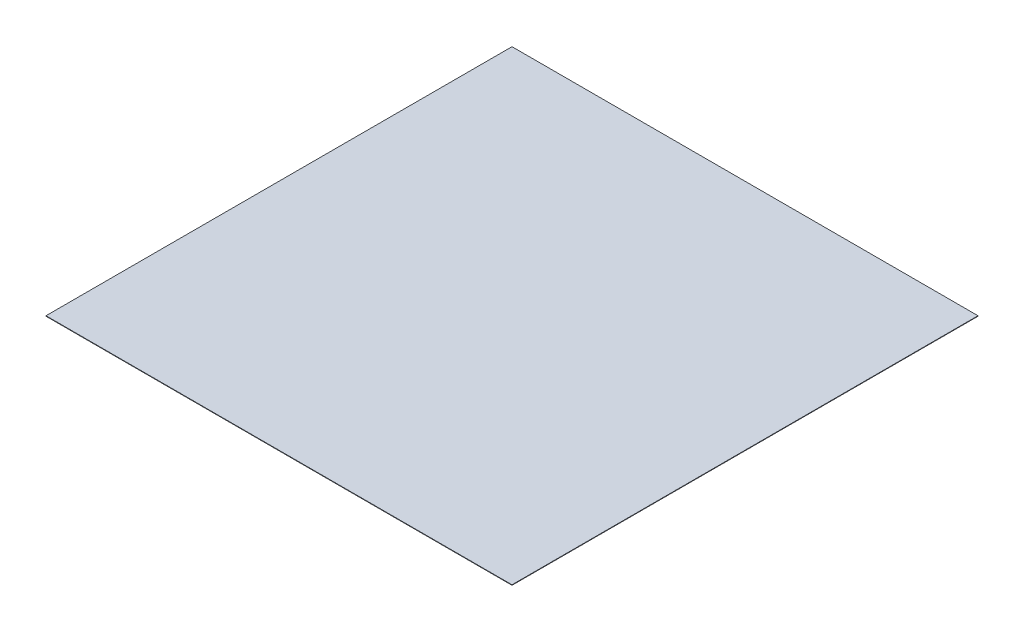
ISO-10303-21;
HEADER;
FILE_DESCRIPTION(('STEP AP214'),'2;1');
FILE_NAME('part.step','',(''),(''),'','','');
FILE_SCHEMA(('AUTOMOTIVE_DESIGN { 1 0 10303 214 1 1 1 1 }'));
ENDSEC;
DATA;
#1=APPLICATION_CONTEXT('core data for automotive mechanical design processes');
#2=APPLICATION_PROTOCOL_DEFINITION('international standard','automotive_design',2000,#1);
#3=PRODUCT_CONTEXT('',#1,'mechanical');
#4=PRODUCT('Part','Part','',(#3));
#5=PRODUCT_RELATED_PRODUCT_CATEGORY('part','',(#4));
#6=PRODUCT_DEFINITION_FORMATION('','',#4);
#7=PRODUCT_DEFINITION_CONTEXT('part definition',#1,'design');
#8=PRODUCT_DEFINITION('design','',#6,#7);
#9=PRODUCT_DEFINITION_SHAPE('','',#8);
#10=(LENGTH_UNIT() NAMED_UNIT(*) SI_UNIT(.MILLI.,.METRE.));
#11=(NAMED_UNIT(*) PLANE_ANGLE_UNIT() SI_UNIT($,.RADIAN.));
#12=(NAMED_UNIT(*) SI_UNIT($,.STERADIAN.) SOLID_ANGLE_UNIT());
#13=UNCERTAINTY_MEASURE_WITH_UNIT(LENGTH_MEASURE(1.E-05),#10,'distance_accuracy_value','');
#14=(GEOMETRIC_REPRESENTATION_CONTEXT(3) GLOBAL_UNCERTAINTY_ASSIGNED_CONTEXT((#13)) GLOBAL_UNIT_ASSIGNED_CONTEXT((#10,
#11,#12)) REPRESENTATION_CONTEXT('',''));
#15=CARTESIAN_POINT('',(0.,0.,0.));
#16=DIRECTION('',(0.,0.,1.));
#17=DIRECTION('',(1.,0.,0.));
#18=AXIS2_PLACEMENT_3D('',#15,#16,#17);
#19=CARTESIAN_POINT('',(0.,1.,1000.));
#20=DIRECTION('',(1.,0.,0.));
#21=DIRECTION('',(0.,0.,-1.));
#22=AXIS2_PLACEMENT_3D('',#19,#20,#21);
#23=PLANE('',#22);
#24=DIRECTION('',(0.,-1.,0.));
#25=VECTOR('',#24,1.);
#26=CARTESIAN_POINT('',(0.,1.,0.));
#27=LINE('',#26,#25);
#28=CARTESIAN_POINT('',(0.,1.,0.));
#29=VERTEX_POINT('',#28);
#30=CARTESIAN_POINT('',(0.,0.,0.));
#31=VERTEX_POINT('',#30);
#32=EDGE_CURVE('E107',#29,#31,#27,.T.);
#33=ORIENTED_EDGE('',*,*,#32,.T.);
#34=DIRECTION('',(0.,0.,-1.));
#35=VECTOR('',#34,1.);
#36=CARTESIAN_POINT('',(0.,0.,1000.));
#37=LINE('',#36,#35);
#38=CARTESIAN_POINT('',(0.,0.,1000.));
#39=VERTEX_POINT('',#38);
#40=EDGE_CURVE('E11',#39,#31,#37,.T.);
#41=ORIENTED_EDGE('',*,*,#40,.F.);
#42=DIRECTION('',(0.,-1.,0.));
#43=VECTOR('',#42,1.);
#44=CARTESIAN_POINT('',(0.,1.,1000.));
#45=LINE('',#44,#43);
#46=CARTESIAN_POINT('',(0.,1.,1000.));
#47=VERTEX_POINT('',#46);
#48=EDGE_CURVE('E91',#47,#39,#45,.T.);
#49=ORIENTED_EDGE('',*,*,#48,.F.);
#50=DIRECTION('',(0.,0.,-1.));
#51=VECTOR('',#50,1.);
#52=CARTESIAN_POINT('',(0.,1.,1000.));
#53=LINE('',#52,#51);
#54=EDGE_CURVE('E103',#47,#29,#53,.T.);
#55=ORIENTED_EDGE('',*,*,#54,.T.);
#56=EDGE_LOOP('',(#33,#41,#49,#55));
#57=FACE_BOUND('',#56,.T.);
#58=ADVANCED_FACE('F39',(#57),#23,.F.);
#59=CARTESIAN_POINT('',(0.,0.,1000.));
#60=DIRECTION('',(0.,1.,0.));
#61=DIRECTION('',(0.,0.,1.));
#62=AXIS2_PLACEMENT_3D('',#59,#60,#61);
#63=PLANE('',#62);
#64=DIRECTION('',(1.,0.,0.));
#65=VECTOR('',#64,1.);
#66=CARTESIAN_POINT('',(0.,0.,0.));
#67=LINE('',#66,#65);
#68=CARTESIAN_POINT('',(1000.,0.,0.));
#69=VERTEX_POINT('',#68);
#70=EDGE_CURVE('E96',#31,#69,#67,.T.);
#71=ORIENTED_EDGE('',*,*,#70,.T.);
#72=DIRECTION('',(0.,0.,-1.));
#73=VECTOR('',#72,1.);
#74=CARTESIAN_POINT('',(1000.,0.,1000.));
#75=LINE('',#74,#73);
#76=CARTESIAN_POINT('',(1000.,0.,1000.));
#77=VERTEX_POINT('',#76);
#78=EDGE_CURVE('E48',#77,#69,#75,.T.);
#79=ORIENTED_EDGE('',*,*,#78,.F.);
#80=DIRECTION('',(1.,0.,0.));
#81=VECTOR('',#80,1.);
#82=CARTESIAN_POINT('',(0.,0.,1000.));
#83=LINE('',#82,#81);
#84=EDGE_CURVE('E86',#39,#77,#83,.T.);
#85=ORIENTED_EDGE('',*,*,#84,.F.);
#86=ORIENTED_EDGE('',*,*,#40,.T.);
#87=EDGE_LOOP('',(#71,#79,#85,#86));
#88=FACE_BOUND('',#87,.T.);
#89=ADVANCED_FACE('F95',(#88),#63,.F.);
#90=CARTESIAN_POINT('',(1000.,0.,1000.));
#91=DIRECTION('',(-1.,0.,0.));
#92=DIRECTION('',(0.,0.,1.));
#93=AXIS2_PLACEMENT_3D('',#90,#91,#92);
#94=PLANE('',#93);
#95=DIRECTION('',(0.,1.,0.));
#96=VECTOR('',#95,1.);
#97=CARTESIAN_POINT('',(1000.,0.,0.));
#98=LINE('',#97,#96);
#99=CARTESIAN_POINT('',(1000.,1.,0.));
#100=VERTEX_POINT('',#99);
#101=EDGE_CURVE('E73',#69,#100,#98,.T.);
#102=ORIENTED_EDGE('',*,*,#101,.T.);
#103=DIRECTION('',(0.,0.,-1.));
#104=VECTOR('',#103,1.);
#105=CARTESIAN_POINT('',(1000.,1.,1000.));
#106=LINE('',#105,#104);
#107=CARTESIAN_POINT('',(1000.,1.,1000.));
#108=VERTEX_POINT('',#107);
#109=EDGE_CURVE('E98',#108,#100,#106,.T.);
#110=ORIENTED_EDGE('',*,*,#109,.F.);
#111=DIRECTION('',(0.,1.,0.));
#112=VECTOR('',#111,1.);
#113=CARTESIAN_POINT('',(1000.,0.,1000.));
#114=LINE('',#113,#112);
#115=EDGE_CURVE('E89',#77,#108,#114,.T.);
#116=ORIENTED_EDGE('',*,*,#115,.F.);
#117=ORIENTED_EDGE('',*,*,#78,.T.);
#118=EDGE_LOOP('',(#102,#110,#116,#117));
#119=FACE_BOUND('',#118,.T.);
#120=ADVANCED_FACE('F99',(#119),#94,.F.);
#121=CARTESIAN_POINT('',(1000.,1.,1000.));
#122=DIRECTION('',(0.,-1.,0.));
#123=DIRECTION('',(0.,0.,-1.));
#124=AXIS2_PLACEMENT_3D('',#121,#122,#123);
#125=PLANE('',#124);
#126=DIRECTION('',(-1.,0.,0.));
#127=VECTOR('',#126,1.);
#128=CARTESIAN_POINT('',(1000.,1.,0.));
#129=LINE('',#128,#127);
#130=EDGE_CURVE('E79',#100,#29,#129,.T.);
#131=ORIENTED_EDGE('',*,*,#130,.T.);
#132=ORIENTED_EDGE('',*,*,#54,.F.);
#133=DIRECTION('',(-1.,0.,0.));
#134=VECTOR('',#133,1.);
#135=CARTESIAN_POINT('',(1000.,1.,1000.));
#136=LINE('',#135,#134);
#137=EDGE_CURVE('E56',#108,#47,#136,.T.);
#138=ORIENTED_EDGE('',*,*,#137,.F.);
#139=ORIENTED_EDGE('',*,*,#109,.T.);
#140=EDGE_LOOP('',(#131,#132,#138,#139));
#141=FACE_BOUND('',#140,.T.);
#142=ADVANCED_FACE('F120',(#141),#125,.F.);
#143=CARTESIAN_POINT('',(0.,0.,1000.));
#144=DIRECTION('',(0.,0.,1.));
#145=DIRECTION('',(1.,0.,0.));
#146=AXIS2_PLACEMENT_3D('',#143,#144,#145);
#147=PLANE('',#146);
#148=ORIENTED_EDGE('',*,*,#48,.T.);
#149=ORIENTED_EDGE('',*,*,#84,.T.);
#150=ORIENTED_EDGE('',*,*,#115,.T.);
#151=ORIENTED_EDGE('',*,*,#137,.T.);
#152=EDGE_LOOP('',(#148,#149,#150,#151));
#153=FACE_BOUND('',#152,.T.);
#154=ADVANCED_FACE('F87',(#153),#147,.T.);
#155=CARTESIAN_POINT('',(0.,0.,0.));
#156=DIRECTION('',(0.,0.,1.));
#157=DIRECTION('',(1.,0.,0.));
#158=AXIS2_PLACEMENT_3D('',#155,#156,#157);
#159=PLANE('',#158);
#160=ORIENTED_EDGE('',*,*,#32,.F.);
#161=ORIENTED_EDGE('',*,*,#130,.F.);
#162=ORIENTED_EDGE('',*,*,#101,.F.);
#163=ORIENTED_EDGE('',*,*,#70,.F.);
#164=EDGE_LOOP('',(#160,#161,#162,#163));
#165=FACE_BOUND('',#164,.T.);
#166=ADVANCED_FACE('F123',(#165),#159,.F.);
#167=CLOSED_SHELL('',(#58,#89,#120,#142,#154,#166));
#168=MANIFOLD_SOLID_BREP('B2',#167);
#169=ADVANCED_BREP_SHAPE_REPRESENTATION('',(#18,#168),#14);
#170=SHAPE_DEFINITION_REPRESENTATION(#9,#169);
ENDSEC;
END-ISO-10303-21;
